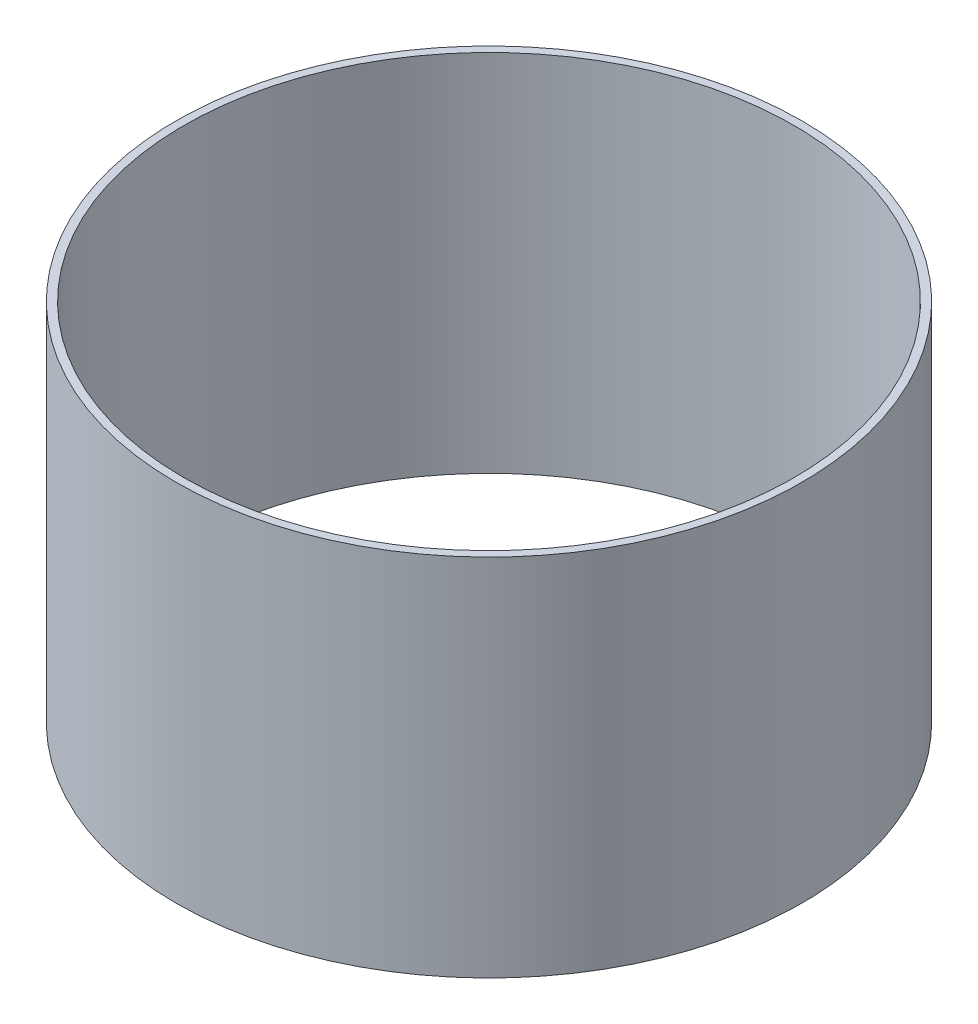
ISO-10303-21;
HEADER;
FILE_DESCRIPTION(('STEP AP214'),'2;1');
FILE_NAME('part.step','',(''),(''),'','','');
FILE_SCHEMA(('AUTOMOTIVE_DESIGN { 1 0 10303 214 1 1 1 1 }'));
ENDSEC;
DATA;
#1=APPLICATION_CONTEXT('core data for automotive mechanical design processes');
#2=APPLICATION_PROTOCOL_DEFINITION('international standard','automotive_design',2000,#1);
#3=PRODUCT_CONTEXT('',#1,'mechanical');
#4=PRODUCT('Part','Part','',(#3));
#5=PRODUCT_RELATED_PRODUCT_CATEGORY('part','',(#4));
#6=PRODUCT_DEFINITION_FORMATION('','',#4);
#7=PRODUCT_DEFINITION_CONTEXT('part definition',#1,'design');
#8=PRODUCT_DEFINITION('design','',#6,#7);
#9=PRODUCT_DEFINITION_SHAPE('','',#8);
#10=(LENGTH_UNIT() NAMED_UNIT(*) SI_UNIT(.MILLI.,.METRE.));
#11=(NAMED_UNIT(*) PLANE_ANGLE_UNIT() SI_UNIT($,.RADIAN.));
#12=(NAMED_UNIT(*) SI_UNIT($,.STERADIAN.) SOLID_ANGLE_UNIT());
#13=UNCERTAINTY_MEASURE_WITH_UNIT(LENGTH_MEASURE(1.E-05),#10,'distance_accuracy_value','');
#14=(GEOMETRIC_REPRESENTATION_CONTEXT(3) GLOBAL_UNCERTAINTY_ASSIGNED_CONTEXT((#13)) GLOBAL_UNIT_ASSIGNED_CONTEXT((#10,
#11,#12)) REPRESENTATION_CONTEXT('',''));
#15=CARTESIAN_POINT('',(0.,0.,0.));
#16=DIRECTION('',(0.,0.,1.));
#17=DIRECTION('',(1.,0.,0.));
#18=AXIS2_PLACEMENT_3D('',#15,#16,#17);
#19=CARTESIAN_POINT('',(0.,92.,0.));
#20=DIRECTION('',(0.,1.,0.));
#21=DIRECTION('',(0.,0.,1.));
#22=AXIS2_PLACEMENT_3D('',#19,#20,#21);
#23=PLANE('',#22);
#24=CARTESIAN_POINT('',(0.,92.,0.));
#25=DIRECTION('',(0.,1.,0.));
#26=DIRECTION('',(0.,0.,1.));
#27=AXIS2_PLACEMENT_3D('',#24,#25,#26);
#28=CIRCLE('',#27,79.);
#29=CARTESIAN_POINT('',(0.,92.,79.));
#30=VERTEX_POINT('',#29);
#31=EDGE_CURVE('E10',#30,#30,#28,.T.);
#32=ORIENTED_EDGE('',*,*,#31,.T.);
#33=EDGE_LOOP('',(#32));
#34=FACE_BOUND('',#33,.T.);
#35=CARTESIAN_POINT('',(0.,92.,0.));
#36=DIRECTION('',(0.,1.,0.));
#37=DIRECTION('',(0.,0.,1.));
#38=AXIS2_PLACEMENT_3D('',#35,#36,#37);
#39=CIRCLE('',#38,77.);
#40=CARTESIAN_POINT('',(0.,92.,77.));
#41=VERTEX_POINT('',#40);
#42=EDGE_CURVE('E48',#41,#41,#39,.T.);
#43=ORIENTED_EDGE('',*,*,#42,.F.);
#44=EDGE_LOOP('',(#43));
#45=FACE_BOUND('',#44,.T.);
#46=ADVANCED_FACE('F37',(#34,#45),#23,.T.);
#47=CARTESIAN_POINT('',(0.,0.,0.));
#48=DIRECTION('',(0.,1.,0.));
#49=DIRECTION('',(0.,0.,1.));
#50=AXIS2_PLACEMENT_3D('',#47,#48,#49);
#51=PLANE('',#50);
#52=CARTESIAN_POINT('',(0.,0.,0.));
#53=DIRECTION('',(0.,1.,0.));
#54=DIRECTION('',(0.,0.,1.));
#55=AXIS2_PLACEMENT_3D('',#52,#53,#54);
#56=CIRCLE('',#55,79.);
#57=CARTESIAN_POINT('',(0.,0.,79.));
#58=VERTEX_POINT('',#57);
#59=EDGE_CURVE('E41',#58,#58,#56,.T.);
#60=ORIENTED_EDGE('',*,*,#59,.F.);
#61=EDGE_LOOP('',(#60));
#62=FACE_BOUND('',#61,.T.);
#63=CARTESIAN_POINT('',(0.,0.,0.));
#64=DIRECTION('',(0.,1.,0.));
#65=DIRECTION('',(0.,0.,1.));
#66=AXIS2_PLACEMENT_3D('',#63,#64,#65);
#67=CIRCLE('',#66,77.);
#68=CARTESIAN_POINT('',(0.,0.,77.));
#69=VERTEX_POINT('',#68);
#70=EDGE_CURVE('E50',#69,#69,#67,.T.);
#71=ORIENTED_EDGE('',*,*,#70,.T.);
#72=EDGE_LOOP('',(#71));
#73=FACE_BOUND('',#72,.T.);
#74=ADVANCED_FACE('F60',(#62,#73),#51,.F.);
#75=CARTESIAN_POINT('',(0.,92.,0.));
#76=DIRECTION('',(0.,-1.,0.));
#77=DIRECTION('',(0.,0.,-1.));
#78=AXIS2_PLACEMENT_3D('',#75,#76,#77);
#79=CYLINDRICAL_SURFACE('',#78,79.);
#80=ORIENTED_EDGE('',*,*,#31,.F.);
#81=EDGE_LOOP('',(#80));
#82=FACE_BOUND('',#81,.T.);
#83=ORIENTED_EDGE('',*,*,#59,.T.);
#84=EDGE_LOOP('',(#83));
#85=FACE_BOUND('',#84,.T.);
#86=ADVANCED_FACE('F39',(#82,#85),#79,.T.);
#87=CARTESIAN_POINT('',(0.,92.,0.));
#88=DIRECTION('',(0.,-1.,0.));
#89=DIRECTION('',(0.,0.,-1.));
#90=AXIS2_PLACEMENT_3D('',#87,#88,#89);
#91=CYLINDRICAL_SURFACE('',#90,77.);
#92=ORIENTED_EDGE('',*,*,#42,.T.);
#93=EDGE_LOOP('',(#92));
#94=FACE_BOUND('',#93,.T.);
#95=ORIENTED_EDGE('',*,*,#70,.F.);
#96=EDGE_LOOP('',(#95));
#97=FACE_BOUND('',#96,.T.);
#98=ADVANCED_FACE('F56',(#94,#97),#91,.F.);
#99=CLOSED_SHELL('',(#46,#74,#86,#98));
#100=MANIFOLD_SOLID_BREP('B2',#99);
#101=ADVANCED_BREP_SHAPE_REPRESENTATION('',(#18,#100),#14);
#102=SHAPE_DEFINITION_REPRESENTATION(#9,#101);
ENDSEC;
END-ISO-10303-21;
